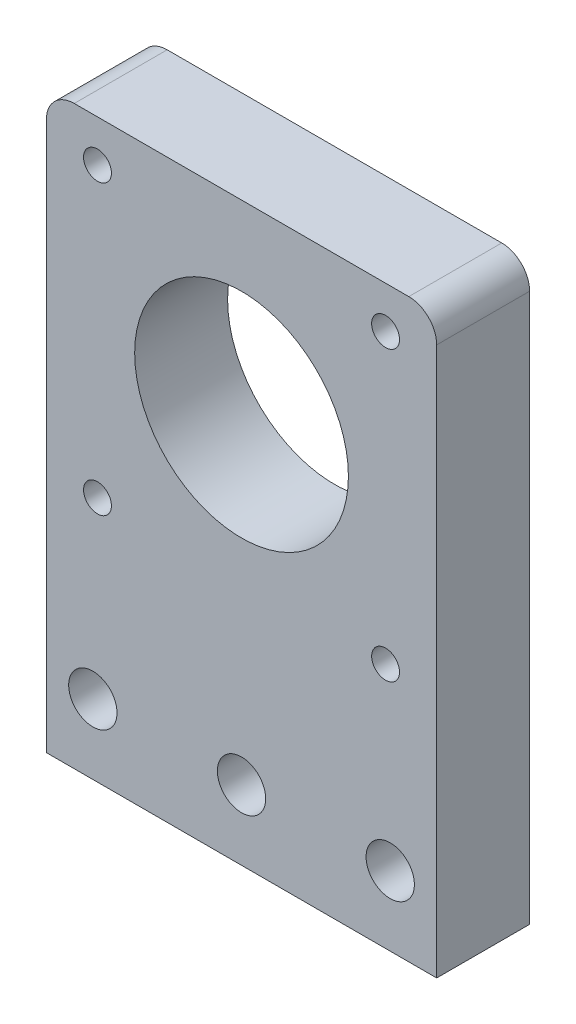
ISO-10303-21;
HEADER;
FILE_DESCRIPTION(('STEP AP214'),'2;1');
FILE_NAME('part.step','',(''),(''),'','','');
FILE_SCHEMA(('AUTOMOTIVE_DESIGN { 1 0 10303 214 1 1 1 1 }'));
ENDSEC;
DATA;
#1=APPLICATION_CONTEXT('core data for automotive mechanical design processes');
#2=APPLICATION_PROTOCOL_DEFINITION('international standard','automotive_design',2000,#1);
#3=PRODUCT_CONTEXT('',#1,'mechanical');
#4=PRODUCT('Part','Part','',(#3));
#5=PRODUCT_RELATED_PRODUCT_CATEGORY('part','',(#4));
#6=PRODUCT_DEFINITION_FORMATION('','',#4);
#7=PRODUCT_DEFINITION_CONTEXT('part definition',#1,'design');
#8=PRODUCT_DEFINITION('design','',#6,#7);
#9=PRODUCT_DEFINITION_SHAPE('','',#8);
#10=(LENGTH_UNIT() NAMED_UNIT(*) SI_UNIT(.MILLI.,.METRE.));
#11=(NAMED_UNIT(*) PLANE_ANGLE_UNIT() SI_UNIT($,.RADIAN.));
#12=(NAMED_UNIT(*) SI_UNIT($,.STERADIAN.) SOLID_ANGLE_UNIT());
#13=UNCERTAINTY_MEASURE_WITH_UNIT(LENGTH_MEASURE(1.E-05),#10,'distance_accuracy_value','');
#14=(GEOMETRIC_REPRESENTATION_CONTEXT(3) GLOBAL_UNCERTAINTY_ASSIGNED_CONTEXT((#13)) GLOBAL_UNIT_ASSIGNED_CONTEXT((#10,
#11,#12)) REPRESENTATION_CONTEXT('',''));
#15=CARTESIAN_POINT('',(0.,0.,0.));
#16=DIRECTION('',(0.,0.,1.));
#17=DIRECTION('',(1.,0.,0.));
#18=AXIS2_PLACEMENT_3D('',#15,#16,#17);
#19=CARTESIAN_POINT('',(0.,0.,10.));
#20=DIRECTION('',(0.,0.,1.));
#21=DIRECTION('',(1.,0.,0.));
#22=AXIS2_PLACEMENT_3D('',#19,#20,#21);
#23=PLANE('',#22);
#24=CARTESIAN_POINT('',(5.,7.5,10.));
#25=DIRECTION('',(0.,0.,1.));
#26=DIRECTION('',(1.,0.,0.));
#27=AXIS2_PLACEMENT_3D('',#24,#25,#26);
#28=CIRCLE('',#27,2.6);
#29=CARTESIAN_POINT('',(7.6,7.5,10.));
#30=VERTEX_POINT('',#29);
#31=EDGE_CURVE('E227',#30,#30,#28,.T.);
#32=ORIENTED_EDGE('',*,*,#31,.F.);
#33=EDGE_LOOP('',(#32));
#34=FACE_BOUND('',#33,.T.);
#35=CARTESIAN_POINT('',(21.,7.5,10.));
#36=DIRECTION('',(0.,0.,1.));
#37=DIRECTION('',(1.,0.,0.));
#38=AXIS2_PLACEMENT_3D('',#35,#36,#37);
#39=CIRCLE('',#38,2.6);
#40=CARTESIAN_POINT('',(23.6,7.5,10.));
#41=VERTEX_POINT('',#40);
#42=EDGE_CURVE('E228',#41,#41,#39,.T.);
#43=ORIENTED_EDGE('',*,*,#42,.F.);
#44=EDGE_LOOP('',(#43));
#45=FACE_BOUND('',#44,.T.);
#46=CARTESIAN_POINT('',(37.,7.5,10.));
#47=DIRECTION('',(0.,0.,1.));
#48=DIRECTION('',(1.,0.,0.));
#49=AXIS2_PLACEMENT_3D('',#46,#47,#48);
#50=CIRCLE('',#49,2.6);
#51=CARTESIAN_POINT('',(39.6,7.5,10.));
#52=VERTEX_POINT('',#51);
#53=EDGE_CURVE('E238',#52,#52,#50,.T.);
#54=ORIENTED_EDGE('',*,*,#53,.F.);
#55=EDGE_LOOP('',(#54));
#56=FACE_BOUND('',#55,.T.);
#57=CARTESIAN_POINT('',(5.49999999999998,26.5,10.));
#58=DIRECTION('',(0.,0.,1.));
#59=DIRECTION('',(1.,0.,0.));
#60=AXIS2_PLACEMENT_3D('',#57,#58,#59);
#61=CIRCLE('',#60,1.5);
#62=CARTESIAN_POINT('',(6.99999999999998,26.5,10.));
#63=VERTEX_POINT('',#62);
#64=EDGE_CURVE('E257',#63,#63,#61,.T.);
#65=ORIENTED_EDGE('',*,*,#64,.F.);
#66=EDGE_LOOP('',(#65));
#67=FACE_BOUND('',#66,.T.);
#68=CARTESIAN_POINT('',(36.5,26.5,10.));
#69=DIRECTION('',(0.,0.,1.));
#70=DIRECTION('',(1.,0.,0.));
#71=AXIS2_PLACEMENT_3D('',#68,#69,#70);
#72=CIRCLE('',#71,1.5);
#73=CARTESIAN_POINT('',(38.,26.5,10.));
#74=VERTEX_POINT('',#73);
#75=EDGE_CURVE('E251',#74,#74,#72,.T.);
#76=ORIENTED_EDGE('',*,*,#75,.F.);
#77=EDGE_LOOP('',(#76));
#78=FACE_BOUND('',#77,.T.);
#79=CARTESIAN_POINT('',(36.5,57.5,10.));
#80=DIRECTION('',(0.,0.,1.));
#81=DIRECTION('',(1.,0.,0.));
#82=AXIS2_PLACEMENT_3D('',#79,#80,#81);
#83=CIRCLE('',#82,1.5);
#84=CARTESIAN_POINT('',(38.,57.5,10.));
#85=VERTEX_POINT('',#84);
#86=EDGE_CURVE('E244',#85,#85,#83,.T.);
#87=ORIENTED_EDGE('',*,*,#86,.F.);
#88=EDGE_LOOP('',(#87));
#89=FACE_BOUND('',#88,.T.);
#90=CARTESIAN_POINT('',(5.49999999999998,57.5,10.));
#91=DIRECTION('',(0.,0.,1.));
#92=DIRECTION('',(1.,0.,0.));
#93=AXIS2_PLACEMENT_3D('',#90,#91,#92);
#94=CIRCLE('',#93,1.5);
#95=CARTESIAN_POINT('',(6.99999999999998,57.5,10.));
#96=VERTEX_POINT('',#95);
#97=EDGE_CURVE('E247',#96,#96,#94,.T.);
#98=ORIENTED_EDGE('',*,*,#97,.F.);
#99=EDGE_LOOP('',(#98));
#100=FACE_BOUND('',#99,.T.);
#101=DIRECTION('',(0.,1.,0.));
#102=VECTOR('',#101,1.);
#103=CARTESIAN_POINT('',(42.,0.,10.));
#104=LINE('',#103,#102);
#105=CARTESIAN_POINT('',(42.,0.,10.));
#106=VERTEX_POINT('',#105);
#107=CARTESIAN_POINT('',(42.,59.,10.));
#108=VERTEX_POINT('',#107);
#109=EDGE_CURVE('E113',#106,#108,#104,.T.);
#110=ORIENTED_EDGE('',*,*,#109,.T.);
#111=CARTESIAN_POINT('',(39.,59.,10.));
#112=DIRECTION('',(0.,0.,1.));
#113=DIRECTION('',(1.,0.,0.));
#114=AXIS2_PLACEMENT_3D('',#111,#112,#113);
#115=CIRCLE('',#114,3.);
#116=CARTESIAN_POINT('',(39.,62.,10.));
#117=VERTEX_POINT('',#116);
#118=EDGE_CURVE('E63',#108,#117,#115,.T.);
#119=ORIENTED_EDGE('',*,*,#118,.T.);
#120=DIRECTION('',(1.,0.,0.));
#121=VECTOR('',#120,1.);
#122=CARTESIAN_POINT('',(0.,62.,10.));
#123=LINE('',#122,#121);
#124=CARTESIAN_POINT('',(2.99999999999999,62.,10.));
#125=VERTEX_POINT('',#124);
#126=EDGE_CURVE('E127',#125,#117,#123,.T.);
#127=ORIENTED_EDGE('',*,*,#126,.F.);
#128=CARTESIAN_POINT('',(2.99999999999999,59.,10.));
#129=DIRECTION('',(0.,0.,1.));
#130=DIRECTION('',(1.,0.,0.));
#131=AXIS2_PLACEMENT_3D('',#128,#129,#130);
#132=CIRCLE('',#131,3.);
#133=CARTESIAN_POINT('',(0.,59.,10.));
#134=VERTEX_POINT('',#133);
#135=EDGE_CURVE('E70',#125,#134,#132,.T.);
#136=ORIENTED_EDGE('',*,*,#135,.T.);
#137=DIRECTION('',(0.,1.,0.));
#138=VECTOR('',#137,1.);
#139=CARTESIAN_POINT('',(0.,0.,10.));
#140=LINE('',#139,#138);
#141=CARTESIAN_POINT('',(0.,0.,10.));
#142=VERTEX_POINT('',#141);
#143=EDGE_CURVE('E115',#142,#134,#140,.T.);
#144=ORIENTED_EDGE('',*,*,#143,.F.);
#145=DIRECTION('',(1.,0.,0.));
#146=VECTOR('',#145,1.);
#147=CARTESIAN_POINT('',(0.,0.,10.));
#148=LINE('',#147,#146);
#149=EDGE_CURVE('E110',#142,#106,#148,.T.);
#150=ORIENTED_EDGE('',*,*,#149,.T.);
#151=EDGE_LOOP('',(#110,#119,#127,#136,#144,#150));
#152=FACE_BOUND('',#151,.T.);
#153=CARTESIAN_POINT('',(21.,42.,10.));
#154=DIRECTION('',(0.,0.,1.));
#155=DIRECTION('',(1.,0.,0.));
#156=AXIS2_PLACEMENT_3D('',#153,#154,#155);
#157=CIRCLE('',#156,11.5);
#158=CARTESIAN_POINT('',(32.5,42.,10.));
#159=VERTEX_POINT('',#158);
#160=EDGE_CURVE('E139',#159,#159,#157,.T.);
#161=ORIENTED_EDGE('',*,*,#160,.F.);
#162=EDGE_LOOP('',(#161));
#163=FACE_BOUND('',#162,.T.);
#164=ADVANCED_FACE('F55',(#34,#45,#56,#67,#78,#89,#100,#152,#163),#23,.T.);
#165=CARTESIAN_POINT('',(0.,0.,0.));
#166=DIRECTION('',(0.,0.,1.));
#167=DIRECTION('',(1.,0.,0.));
#168=AXIS2_PLACEMENT_3D('',#165,#166,#167);
#169=PLANE('',#168);
#170=CARTESIAN_POINT('',(5.,7.5,0.));
#171=DIRECTION('',(0.,0.,1.));
#172=DIRECTION('',(1.,0.,0.));
#173=AXIS2_PLACEMENT_3D('',#170,#171,#172);
#174=CIRCLE('',#173,2.6);
#175=CARTESIAN_POINT('',(7.6,7.5,0.));
#176=VERTEX_POINT('',#175);
#177=EDGE_CURVE('E225',#176,#176,#174,.T.);
#178=ORIENTED_EDGE('',*,*,#177,.T.);
#179=EDGE_LOOP('',(#178));
#180=FACE_BOUND('',#179,.T.);
#181=CARTESIAN_POINT('',(21.,7.5,0.));
#182=DIRECTION('',(0.,0.,1.));
#183=DIRECTION('',(1.,0.,0.));
#184=AXIS2_PLACEMENT_3D('',#181,#182,#183);
#185=CIRCLE('',#184,2.6);
#186=CARTESIAN_POINT('',(23.6,7.5,0.));
#187=VERTEX_POINT('',#186);
#188=EDGE_CURVE('E233',#187,#187,#185,.T.);
#189=ORIENTED_EDGE('',*,*,#188,.T.);
#190=EDGE_LOOP('',(#189));
#191=FACE_BOUND('',#190,.T.);
#192=CARTESIAN_POINT('',(37.,7.5,0.));
#193=DIRECTION('',(0.,0.,1.));
#194=DIRECTION('',(1.,0.,0.));
#195=AXIS2_PLACEMENT_3D('',#192,#193,#194);
#196=CIRCLE('',#195,2.6);
#197=CARTESIAN_POINT('',(39.6,7.5,0.));
#198=VERTEX_POINT('',#197);
#199=EDGE_CURVE('E241',#198,#198,#196,.T.);
#200=ORIENTED_EDGE('',*,*,#199,.T.);
#201=EDGE_LOOP('',(#200));
#202=FACE_BOUND('',#201,.T.);
#203=CARTESIAN_POINT('',(5.49999999999998,26.5,0.));
#204=DIRECTION('',(0.,0.,1.));
#205=DIRECTION('',(1.,0.,0.));
#206=AXIS2_PLACEMENT_3D('',#203,#204,#205);
#207=CIRCLE('',#206,1.5);
#208=CARTESIAN_POINT('',(6.99999999999998,26.5,0.));
#209=VERTEX_POINT('',#208);
#210=EDGE_CURVE('E230',#209,#209,#207,.T.);
#211=ORIENTED_EDGE('',*,*,#210,.T.);
#212=EDGE_LOOP('',(#211));
#213=FACE_BOUND('',#212,.T.);
#214=CARTESIAN_POINT('',(36.5,26.5,0.));
#215=DIRECTION('',(0.,0.,1.));
#216=DIRECTION('',(1.,0.,0.));
#217=AXIS2_PLACEMENT_3D('',#214,#215,#216);
#218=CIRCLE('',#217,1.5);
#219=CARTESIAN_POINT('',(38.,26.5,0.));
#220=VERTEX_POINT('',#219);
#221=EDGE_CURVE('E254',#220,#220,#218,.T.);
#222=ORIENTED_EDGE('',*,*,#221,.T.);
#223=EDGE_LOOP('',(#222));
#224=FACE_BOUND('',#223,.T.);
#225=CARTESIAN_POINT('',(36.5,57.5,0.));
#226=DIRECTION('',(0.,0.,1.));
#227=DIRECTION('',(1.,0.,0.));
#228=AXIS2_PLACEMENT_3D('',#225,#226,#227);
#229=CIRCLE('',#228,1.5);
#230=CARTESIAN_POINT('',(38.,57.5,0.));
#231=VERTEX_POINT('',#230);
#232=EDGE_CURVE('E248',#231,#231,#229,.T.);
#233=ORIENTED_EDGE('',*,*,#232,.T.);
#234=EDGE_LOOP('',(#233));
#235=FACE_BOUND('',#234,.T.);
#236=CARTESIAN_POINT('',(5.49999999999998,57.5,0.));
#237=DIRECTION('',(0.,0.,1.));
#238=DIRECTION('',(1.,0.,0.));
#239=AXIS2_PLACEMENT_3D('',#236,#237,#238);
#240=CIRCLE('',#239,1.5);
#241=CARTESIAN_POINT('',(6.99999999999998,57.5,0.));
#242=VERTEX_POINT('',#241);
#243=EDGE_CURVE('E262',#242,#242,#240,.T.);
#244=ORIENTED_EDGE('',*,*,#243,.T.);
#245=EDGE_LOOP('',(#244));
#246=FACE_BOUND('',#245,.T.);
#247=DIRECTION('',(1.,0.,0.));
#248=VECTOR('',#247,1.);
#249=CARTESIAN_POINT('',(0.,62.,0.));
#250=LINE('',#249,#248);
#251=CARTESIAN_POINT('',(2.99999999999999,62.,0.));
#252=VERTEX_POINT('',#251);
#253=CARTESIAN_POINT('',(39.,62.,0.));
#254=VERTEX_POINT('',#253);
#255=EDGE_CURVE('E135',#252,#254,#250,.T.);
#256=ORIENTED_EDGE('',*,*,#255,.T.);
#257=CARTESIAN_POINT('',(39.,59.,0.));
#258=DIRECTION('',(0.,0.,1.));
#259=DIRECTION('',(1.,0.,0.));
#260=AXIS2_PLACEMENT_3D('',#257,#258,#259);
#261=CIRCLE('',#260,3.);
#262=CARTESIAN_POINT('',(42.,59.,0.));
#263=VERTEX_POINT('',#262);
#264=EDGE_CURVE('E152',#254,#263,#261,.F.);
#265=ORIENTED_EDGE('',*,*,#264,.T.);
#266=DIRECTION('',(0.,1.,0.));
#267=VECTOR('',#266,1.);
#268=CARTESIAN_POINT('',(42.,0.,0.));
#269=LINE('',#268,#267);
#270=CARTESIAN_POINT('',(42.,0.,0.));
#271=VERTEX_POINT('',#270);
#272=EDGE_CURVE('E138',#271,#263,#269,.T.);
#273=ORIENTED_EDGE('',*,*,#272,.F.);
#274=DIRECTION('',(1.,0.,0.));
#275=VECTOR('',#274,1.);
#276=CARTESIAN_POINT('',(0.,0.,0.));
#277=LINE('',#276,#275);
#278=CARTESIAN_POINT('',(0.,0.,0.));
#279=VERTEX_POINT('',#278);
#280=EDGE_CURVE('E122',#279,#271,#277,.T.);
#281=ORIENTED_EDGE('',*,*,#280,.F.);
#282=DIRECTION('',(0.,1.,0.));
#283=VECTOR('',#282,1.);
#284=CARTESIAN_POINT('',(0.,0.,0.));
#285=LINE('',#284,#283);
#286=CARTESIAN_POINT('',(0.,59.,0.));
#287=VERTEX_POINT('',#286);
#288=EDGE_CURVE('E130',#279,#287,#285,.T.);
#289=ORIENTED_EDGE('',*,*,#288,.T.);
#290=CARTESIAN_POINT('',(2.99999999999999,59.,0.));
#291=DIRECTION('',(0.,0.,1.));
#292=DIRECTION('',(1.,0.,0.));
#293=AXIS2_PLACEMENT_3D('',#290,#291,#292);
#294=CIRCLE('',#293,3.);
#295=EDGE_CURVE('E150',#287,#252,#294,.F.);
#296=ORIENTED_EDGE('',*,*,#295,.T.);
#297=EDGE_LOOP('',(#256,#265,#273,#281,#289,#296));
#298=FACE_BOUND('',#297,.T.);
#299=CARTESIAN_POINT('',(21.,42.,0.));
#300=DIRECTION('',(0.,0.,1.));
#301=DIRECTION('',(1.,0.,0.));
#302=AXIS2_PLACEMENT_3D('',#299,#300,#301);
#303=CIRCLE('',#302,11.5);
#304=CARTESIAN_POINT('',(32.5,42.,0.));
#305=VERTEX_POINT('',#304);
#306=EDGE_CURVE('E265',#305,#305,#303,.T.);
#307=ORIENTED_EDGE('',*,*,#306,.T.);
#308=EDGE_LOOP('',(#307));
#309=FACE_BOUND('',#308,.T.);
#310=ADVANCED_FACE('F163',(#180,#191,#202,#213,#224,#235,#246,#298,#309),#169,.F.);
#311=CARTESIAN_POINT('',(0.,62.,10.));
#312=DIRECTION('',(0.,1.,0.));
#313=DIRECTION('',(0.,0.,1.));
#314=AXIS2_PLACEMENT_3D('',#311,#312,#313);
#315=PLANE('',#314);
#316=ORIENTED_EDGE('',*,*,#126,.T.);
#317=DIRECTION('',(0.,0.,-1.));
#318=VECTOR('',#317,1.);
#319=CARTESIAN_POINT('',(39.,62.,0.));
#320=LINE('',#319,#318);
#321=EDGE_CURVE('E147',#117,#254,#320,.T.);
#322=ORIENTED_EDGE('',*,*,#321,.T.);
#323=ORIENTED_EDGE('',*,*,#255,.F.);
#324=DIRECTION('',(0.,0.,-1.));
#325=VECTOR('',#324,1.);
#326=CARTESIAN_POINT('',(2.99999999999999,62.,10.));
#327=LINE('',#326,#325);
#328=EDGE_CURVE('E144',#252,#125,#327,.F.);
#329=ORIENTED_EDGE('',*,*,#328,.T.);
#330=EDGE_LOOP('',(#316,#322,#323,#329));
#331=FACE_BOUND('',#330,.T.);
#332=ADVANCED_FACE('F158',(#331),#315,.T.);
#333=CARTESIAN_POINT('',(0.,0.,10.));
#334=DIRECTION('',(-1.,0.,0.));
#335=DIRECTION('',(0.,-1.,0.));
#336=AXIS2_PLACEMENT_3D('',#333,#334,#335);
#337=PLANE('',#336);
#338=ORIENTED_EDGE('',*,*,#143,.T.);
#339=DIRECTION('',(0.,0.,-1.));
#340=VECTOR('',#339,1.);
#341=CARTESIAN_POINT('',(0.,59.,10.));
#342=LINE('',#341,#340);
#343=EDGE_CURVE('E12',#134,#287,#342,.T.);
#344=ORIENTED_EDGE('',*,*,#343,.T.);
#345=ORIENTED_EDGE('',*,*,#288,.F.);
#346=DIRECTION('',(0.,0.,-1.));
#347=VECTOR('',#346,1.);
#348=CARTESIAN_POINT('',(0.,0.,10.));
#349=LINE('',#348,#347);
#350=EDGE_CURVE('E124',#142,#279,#349,.T.);
#351=ORIENTED_EDGE('',*,*,#350,.F.);
#352=EDGE_LOOP('',(#338,#344,#345,#351));
#353=FACE_BOUND('',#352,.T.);
#354=ADVANCED_FACE('F169',(#353),#337,.T.);
#355=CARTESIAN_POINT('',(0.,0.,10.));
#356=DIRECTION('',(0.,1.,0.));
#357=DIRECTION('',(0.,0.,1.));
#358=AXIS2_PLACEMENT_3D('',#355,#356,#357);
#359=PLANE('',#358);
#360=ORIENTED_EDGE('',*,*,#280,.T.);
#361=DIRECTION('',(0.,0.,-1.));
#362=VECTOR('',#361,1.);
#363=CARTESIAN_POINT('',(42.,0.,10.));
#364=LINE('',#363,#362);
#365=EDGE_CURVE('E119',#106,#271,#364,.T.);
#366=ORIENTED_EDGE('',*,*,#365,.F.);
#367=ORIENTED_EDGE('',*,*,#149,.F.);
#368=ORIENTED_EDGE('',*,*,#350,.T.);
#369=EDGE_LOOP('',(#360,#366,#367,#368));
#370=FACE_BOUND('',#369,.T.);
#371=ADVANCED_FACE('F120',(#370),#359,.F.);
#372=CARTESIAN_POINT('',(42.,0.,10.));
#373=DIRECTION('',(-1.,0.,0.));
#374=DIRECTION('',(0.,-1.,0.));
#375=AXIS2_PLACEMENT_3D('',#372,#373,#374);
#376=PLANE('',#375);
#377=ORIENTED_EDGE('',*,*,#272,.T.);
#378=DIRECTION('',(0.,0.,-1.));
#379=VECTOR('',#378,1.);
#380=CARTESIAN_POINT('',(42.,59.,10.));
#381=LINE('',#380,#379);
#382=EDGE_CURVE('E78',#263,#108,#381,.F.);
#383=ORIENTED_EDGE('',*,*,#382,.T.);
#384=ORIENTED_EDGE('',*,*,#109,.F.);
#385=ORIENTED_EDGE('',*,*,#365,.T.);
#386=EDGE_LOOP('',(#377,#383,#384,#385));
#387=FACE_BOUND('',#386,.T.);
#388=ADVANCED_FACE('F126',(#387),#376,.F.);
#389=CARTESIAN_POINT('',(21.,42.,10.));
#390=DIRECTION('',(0.,0.,-1.));
#391=DIRECTION('',(-1.,0.,0.));
#392=AXIS2_PLACEMENT_3D('',#389,#390,#391);
#393=CYLINDRICAL_SURFACE('',#392,11.5);
#394=ORIENTED_EDGE('',*,*,#160,.T.);
#395=EDGE_LOOP('',(#394));
#396=FACE_BOUND('',#395,.T.);
#397=ORIENTED_EDGE('',*,*,#306,.F.);
#398=EDGE_LOOP('',(#397));
#399=FACE_BOUND('',#398,.T.);
#400=ADVANCED_FACE('F189',(#396,#399),#393,.F.);
#401=CARTESIAN_POINT('',(39.,59.,10.));
#402=DIRECTION('',(0.,0.,1.));
#403=DIRECTION('',(1.,0.,0.));
#404=AXIS2_PLACEMENT_3D('',#401,#402,#403);
#405=CYLINDRICAL_SURFACE('',#404,3.);
#406=ORIENTED_EDGE('',*,*,#118,.F.);
#407=ORIENTED_EDGE('',*,*,#382,.F.);
#408=ORIENTED_EDGE('',*,*,#264,.F.);
#409=ORIENTED_EDGE('',*,*,#321,.F.);
#410=EDGE_LOOP('',(#406,#407,#408,#409));
#411=FACE_BOUND('',#410,.T.);
#412=ADVANCED_FACE('F161',(#411),#405,.T.);
#413=CARTESIAN_POINT('',(2.99999999999999,59.,10.));
#414=DIRECTION('',(0.,0.,-1.));
#415=DIRECTION('',(-1.,0.,0.));
#416=AXIS2_PLACEMENT_3D('',#413,#414,#415);
#417=CYLINDRICAL_SURFACE('',#416,3.);
#418=ORIENTED_EDGE('',*,*,#135,.F.);
#419=ORIENTED_EDGE('',*,*,#328,.F.);
#420=ORIENTED_EDGE('',*,*,#295,.F.);
#421=ORIENTED_EDGE('',*,*,#343,.F.);
#422=EDGE_LOOP('',(#418,#419,#420,#421));
#423=FACE_BOUND('',#422,.T.);
#424=ADVANCED_FACE('F57',(#423),#417,.T.);
#425=CARTESIAN_POINT('',(5.49999999999998,57.5,0.));
#426=DIRECTION('',(0.,0.,1.));
#427=DIRECTION('',(1.,0.,0.));
#428=AXIS2_PLACEMENT_3D('',#425,#426,#427);
#429=CYLINDRICAL_SURFACE('',#428,1.5);
#430=ORIENTED_EDGE('',*,*,#243,.F.);
#431=EDGE_LOOP('',(#430));
#432=FACE_BOUND('',#431,.T.);
#433=ORIENTED_EDGE('',*,*,#97,.T.);
#434=EDGE_LOOP('',(#433));
#435=FACE_BOUND('',#434,.T.);
#436=ADVANCED_FACE('F193',(#432,#435),#429,.F.);
#437=CARTESIAN_POINT('',(36.5,57.5,0.));
#438=DIRECTION('',(0.,0.,1.));
#439=DIRECTION('',(1.,0.,0.));
#440=AXIS2_PLACEMENT_3D('',#437,#438,#439);
#441=CYLINDRICAL_SURFACE('',#440,1.5);
#442=ORIENTED_EDGE('',*,*,#232,.F.);
#443=EDGE_LOOP('',(#442));
#444=FACE_BOUND('',#443,.T.);
#445=ORIENTED_EDGE('',*,*,#86,.T.);
#446=EDGE_LOOP('',(#445));
#447=FACE_BOUND('',#446,.T.);
#448=ADVANCED_FACE('F196',(#444,#447),#441,.F.);
#449=CARTESIAN_POINT('',(36.5,26.5,0.));
#450=DIRECTION('',(0.,0.,1.));
#451=DIRECTION('',(1.,0.,0.));
#452=AXIS2_PLACEMENT_3D('',#449,#450,#451);
#453=CYLINDRICAL_SURFACE('',#452,1.5);
#454=ORIENTED_EDGE('',*,*,#221,.F.);
#455=EDGE_LOOP('',(#454));
#456=FACE_BOUND('',#455,.T.);
#457=ORIENTED_EDGE('',*,*,#75,.T.);
#458=EDGE_LOOP('',(#457));
#459=FACE_BOUND('',#458,.T.);
#460=ADVANCED_FACE('F202',(#456,#459),#453,.F.);
#461=CARTESIAN_POINT('',(5.49999999999998,26.5,0.));
#462=DIRECTION('',(0.,0.,1.));
#463=DIRECTION('',(1.,0.,0.));
#464=AXIS2_PLACEMENT_3D('',#461,#462,#463);
#465=CYLINDRICAL_SURFACE('',#464,1.5);
#466=ORIENTED_EDGE('',*,*,#210,.F.);
#467=EDGE_LOOP('',(#466));
#468=FACE_BOUND('',#467,.T.);
#469=ORIENTED_EDGE('',*,*,#64,.T.);
#470=EDGE_LOOP('',(#469));
#471=FACE_BOUND('',#470,.T.);
#472=ADVANCED_FACE('F198',(#468,#471),#465,.F.);
#473=CARTESIAN_POINT('',(37.,7.5,0.));
#474=DIRECTION('',(0.,0.,1.));
#475=DIRECTION('',(1.,0.,0.));
#476=AXIS2_PLACEMENT_3D('',#473,#474,#475);
#477=CYLINDRICAL_SURFACE('',#476,2.6);
#478=ORIENTED_EDGE('',*,*,#199,.F.);
#479=EDGE_LOOP('',(#478));
#480=FACE_BOUND('',#479,.T.);
#481=ORIENTED_EDGE('',*,*,#53,.T.);
#482=EDGE_LOOP('',(#481));
#483=FACE_BOUND('',#482,.T.);
#484=ADVANCED_FACE('F201',(#480,#483),#477,.F.);
#485=CARTESIAN_POINT('',(21.,7.5,0.));
#486=DIRECTION('',(0.,0.,1.));
#487=DIRECTION('',(1.,0.,0.));
#488=AXIS2_PLACEMENT_3D('',#485,#486,#487);
#489=CYLINDRICAL_SURFACE('',#488,2.6);
#490=ORIENTED_EDGE('',*,*,#188,.F.);
#491=EDGE_LOOP('',(#490));
#492=FACE_BOUND('',#491,.T.);
#493=ORIENTED_EDGE('',*,*,#42,.T.);
#494=EDGE_LOOP('',(#493));
#495=FACE_BOUND('',#494,.T.);
#496=ADVANCED_FACE('F212',(#492,#495),#489,.F.);
#497=CARTESIAN_POINT('',(5.,7.5,0.));
#498=DIRECTION('',(0.,0.,1.));
#499=DIRECTION('',(1.,0.,0.));
#500=AXIS2_PLACEMENT_3D('',#497,#498,#499);
#501=CYLINDRICAL_SURFACE('',#500,2.6);
#502=ORIENTED_EDGE('',*,*,#177,.F.);
#503=EDGE_LOOP('',(#502));
#504=FACE_BOUND('',#503,.T.);
#505=ORIENTED_EDGE('',*,*,#31,.T.);
#506=EDGE_LOOP('',(#505));
#507=FACE_BOUND('',#506,.T.);
#508=ADVANCED_FACE('F216',(#504,#507),#501,.F.);
#509=CLOSED_SHELL('',(#164,#310,#332,#354,#371,#388,#400,#412,#424,#436,#448,#460,#472,#484,
#496,#508));
#510=MANIFOLD_SOLID_BREP('B2',#509);
#511=ADVANCED_BREP_SHAPE_REPRESENTATION('',(#18,#510),#14);
#512=SHAPE_DEFINITION_REPRESENTATION(#9,#511);
ENDSEC;
END-ISO-10303-21;
